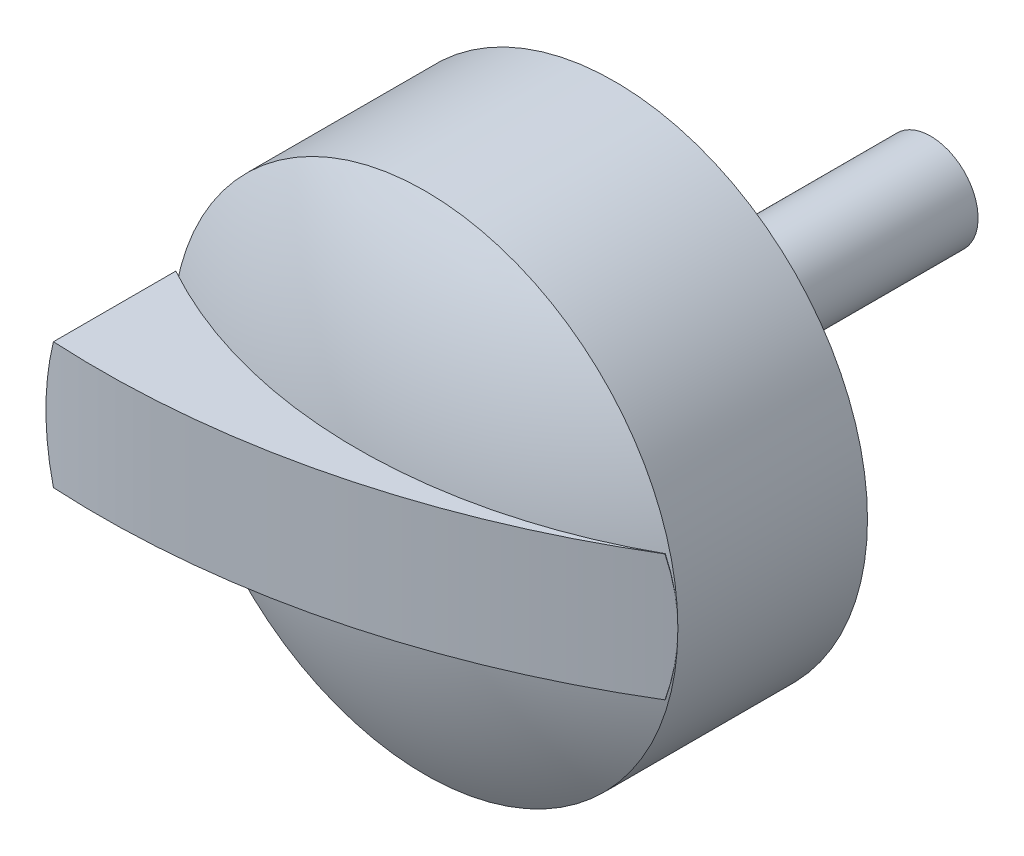
ISO-10303-21;
HEADER;
FILE_DESCRIPTION(('STEP AP214'),'2;1');
FILE_NAME('part.step','',(''),(''),'','','');
FILE_SCHEMA(('AUTOMOTIVE_DESIGN { 1 0 10303 214 1 1 1 1 }'));
ENDSEC;
DATA;
#1=APPLICATION_CONTEXT('core data for automotive mechanical design processes');
#2=APPLICATION_PROTOCOL_DEFINITION('international standard','automotive_design',2000,#1);
#3=PRODUCT_CONTEXT('',#1,'mechanical');
#4=PRODUCT('Part','Part','',(#3));
#5=PRODUCT_RELATED_PRODUCT_CATEGORY('part','',(#4));
#6=PRODUCT_DEFINITION_FORMATION('','',#4);
#7=PRODUCT_DEFINITION_CONTEXT('part definition',#1,'design');
#8=PRODUCT_DEFINITION('design','',#6,#7);
#9=PRODUCT_DEFINITION_SHAPE('','',#8);
#10=(LENGTH_UNIT() NAMED_UNIT(*) SI_UNIT(.MILLI.,.METRE.));
#11=(NAMED_UNIT(*) PLANE_ANGLE_UNIT() SI_UNIT($,.RADIAN.));
#12=(NAMED_UNIT(*) SI_UNIT($,.STERADIAN.) SOLID_ANGLE_UNIT());
#13=UNCERTAINTY_MEASURE_WITH_UNIT(LENGTH_MEASURE(1.E-05),#10,'distance_accuracy_value','');
#14=(GEOMETRIC_REPRESENTATION_CONTEXT(3) GLOBAL_UNCERTAINTY_ASSIGNED_CONTEXT((#13)) GLOBAL_UNIT_ASSIGNED_CONTEXT((#10,
#11,#12)) REPRESENTATION_CONTEXT('',''));
#15=CARTESIAN_POINT('',(0.,0.,0.));
#16=DIRECTION('',(0.,0.,1.));
#17=DIRECTION('',(1.,0.,0.));
#18=AXIS2_PLACEMENT_3D('',#15,#16,#17);
#19=CARTESIAN_POINT('',(0.,-2.,-7.8564064605511));
#20=DIRECTION('',(0.,1.,0.));
#21=DIRECTION('',(0.,0.,1.));
#22=AXIS2_PLACEMENT_3D('',#19,#20,#21);
#23=CYLINDRICAL_SURFACE('',#22,16.0000000000001);
#24=CARTESIAN_POINT('',(7.74596669241484,-2.,6.14359353944898));
#25=CARTESIAN_POINT('',(7.79576878568961,-1.80723335632212,6.11601122336093));
#26=CARTESIAN_POINT('',(7.83845275957321,-1.61207546205608,6.09207370153921));
#27=CARTESIAN_POINT('',(7.90921985467055,-1.21826146996199,6.05208391250416));
#28=CARTESIAN_POINT('',(7.93729738609222,-1.0196040629166,6.03603466421214));
#29=CARTESIAN_POINT('',(7.97795478606474,-0.625014635879123,6.01272209125138));
#30=CARTESIAN_POINT('',(7.99089022957565,-0.42913153883307,6.00525725997612));
#31=CARTESIAN_POINT('',(8.00232100847783,-0.0369095327974962,5.99866112683555));
#32=CARTESIAN_POINT('',(8.00082187339527,0.159429172845951,5.99952663382587));
#33=CARTESIAN_POINT('',(7.97982143754379,0.631381929789678,6.01164126361911));
#34=CARTESIAN_POINT('',(7.95321978946131,0.906632782986515,6.02698571878776));
#35=CARTESIAN_POINT('',(7.89200474609,1.31755744897251,6.06181080763411));
#36=CARTESIAN_POINT('',(7.86774300045165,1.45538772123495,6.07555866000076));
#37=CARTESIAN_POINT('',(7.81213288819257,1.72918322572561,6.1068160347439));
#38=CARTESIAN_POINT('',(7.78078441472819,1.8651484298022,6.12432561383419));
#39=CARTESIAN_POINT('',(7.74596669241484,2.,6.14359353944898));
#40=B_SPLINE_CURVE_WITH_KNOTS('',3,(#24,#25,#26,#27,#28,#29,#30,#31,#32,#33,#34,#35,#36,#37,#38,
#39),.UNSPECIFIED.,.F.,.F.,(4,2,2,2,2,2,2,4),(0.,0.602865336631131,1.20596121656099,
1.79459116140513,2.38299562580781,3.21164500910816,3.63331273593139,4.05498682048761),.UNSPECIFIED.);
#41=CARTESIAN_POINT('',(7.74596669241484,-2.,6.14359353944898));
#42=VERTEX_POINT('',#41);
#43=CARTESIAN_POINT('',(8.00000000000001,0.,6.));
#44=VERTEX_POINT('',#43);
#45=EDGE_CURVE('E142',#42,#44,#40,.T.);
#46=ORIENTED_EDGE('',*,*,#45,.F.);
#47=CARTESIAN_POINT('',(0.,-2.,-7.8564064605511));
#48=DIRECTION('',(0.,-1.,0.));
#49=DIRECTION('',(0.,0.,1.));
#50=AXIS2_PLACEMENT_3D('',#47,#48,#49);
#51=CIRCLE('',#50,16.0000000000001);
#52=CARTESIAN_POINT('',(-7.74596669241484,-2.,6.14359353944898));
#53=VERTEX_POINT('',#52);
#54=EDGE_CURVE('E117',#42,#53,#51,.T.);
#55=ORIENTED_EDGE('',*,*,#54,.T.);
#56=CARTESIAN_POINT('',(-7.74596669241484,2.,6.14359353944898));
#57=CARTESIAN_POINT('',(-7.79576878568961,1.80723335632212,6.11601122336093));
#58=CARTESIAN_POINT('',(-7.83845275957321,1.61207546205608,6.09207370153921));
#59=CARTESIAN_POINT('',(-7.90921985467055,1.21826146996199,6.05208391250416));
#60=CARTESIAN_POINT('',(-7.93729738609222,1.0196040629166,6.03603466421214));
#61=CARTESIAN_POINT('',(-7.97795478606474,0.625014635879123,6.01272209125138));
#62=CARTESIAN_POINT('',(-7.99089022957565,0.42913153883307,6.00525725997612));
#63=CARTESIAN_POINT('',(-8.00232100847783,0.0369095327974962,5.99866112683555));
#64=CARTESIAN_POINT('',(-8.00082187339527,-0.159429172845951,5.99952663382587));
#65=CARTESIAN_POINT('',(-7.97982143754379,-0.631381929789678,6.01164126361911));
#66=CARTESIAN_POINT('',(-7.95321978946131,-0.906632782986515,6.02698571878776));
#67=CARTESIAN_POINT('',(-7.89200474609,-1.31755744897251,6.06181080763411));
#68=CARTESIAN_POINT('',(-7.86774300045165,-1.45538772123495,6.07555866000076));
#69=CARTESIAN_POINT('',(-7.81213288819257,-1.72918322572561,6.1068160347439));
#70=CARTESIAN_POINT('',(-7.78078441472819,-1.8651484298022,6.12432561383419));
#71=CARTESIAN_POINT('',(-7.74596669241484,-2.,6.14359353944898));
#72=B_SPLINE_CURVE_WITH_KNOTS('',3,(#56,#57,#58,#59,#60,#61,#62,#63,#64,#65,#66,#67,#68,#69,#70,
#71),.UNSPECIFIED.,.F.,.F.,(4,2,2,2,2,2,2,4),(0.,0.602865336631131,1.20596121656099,
1.79459116140513,2.38299562580781,3.21164500910816,3.63331273593139,4.05498682048761),.UNSPECIFIED.);
#73=CARTESIAN_POINT('',(-7.74596669241484,2.,6.14359353944898));
#74=VERTEX_POINT('',#73);
#75=EDGE_CURVE('E104',#74,#53,#72,.T.);
#76=ORIENTED_EDGE('',*,*,#75,.F.);
#77=CARTESIAN_POINT('',(0.,2.,-7.8564064605511));
#78=DIRECTION('',(0.,-1.,0.));
#79=DIRECTION('',(0.,0.,1.));
#80=AXIS2_PLACEMENT_3D('',#77,#78,#79);
#81=CIRCLE('',#80,16.0000000000001);
#82=CARTESIAN_POINT('',(7.74596669241484,2.,6.14359353944898));
#83=VERTEX_POINT('',#82);
#84=EDGE_CURVE('E115',#83,#74,#81,.T.);
#85=ORIENTED_EDGE('',*,*,#84,.F.);
#86=EDGE_CURVE('E83',#44,#83,#40,.T.);
#87=ORIENTED_EDGE('',*,*,#86,.F.);
#88=EDGE_LOOP('',(#46,#55,#76,#85,#87));
#89=FACE_BOUND('',#88,.T.);
#90=ADVANCED_FACE('F61',(#89),#23,.F.);
#91=CARTESIAN_POINT('',(-6.23557158095201,-2.,-16.9422863238081));
#92=DIRECTION('',(0.,1.,0.));
#93=DIRECTION('',(0.,0.,1.));
#94=AXIS2_PLACEMENT_3D('',#91,#92,#93);
#95=CYLINDRICAL_SURFACE('',#94,27.);
#96=CARTESIAN_POINT('',(-7.74596669241484,-2.,10.0154343997114));
#97=CARTESIAN_POINT('',(-7.80271458237756,-1.7803181829167,10.0122340134564));
#98=CARTESIAN_POINT('',(-7.85006946093809,-1.55820558532786,10.0094210622351));
#99=CARTESIAN_POINT('',(-7.92576850211965,-1.11067742002907,10.0047909950926));
#100=CARTESIAN_POINT('',(-7.95410633457501,-0.885260777996712,10.0029742108002));
#101=CARTESIAN_POINT('',(-7.99111899857435,-0.437543151719545,10.0005850110123));
#102=CARTESIAN_POINT('',(-8.00019108510677,-0.215275063967891,9.99998746548465));
#103=CARTESIAN_POINT('',(-7.99980290286736,0.229145742237448,10.0000129285272));
#104=CARTESIAN_POINT('',(-7.99035096523731,0.451298467628083,10.0006353884025));
#105=CARTESIAN_POINT('',(-7.95287736313974,0.895353644935162,10.0030525170232));
#106=CARTESIAN_POINT('',(-7.92474581653544,1.1172467857351,10.004854121139));
#107=CARTESIAN_POINT('',(-7.84963261754137,1.56025072122013,10.0094473473001));
#108=CARTESIAN_POINT('',(-7.80245269307478,1.78132780183842,10.0122493456727));
#109=CARTESIAN_POINT('',(-7.74596669241484,2.,10.0154343997114));
#110=B_SPLINE_CURVE_WITH_KNOTS('',3,(#96,#97,#98,#99,#100,#101,#102,#103,#104,#105,#106,#107,
#108,#109),.UNSPECIFIED.,.F.,.F.,(4,2,2,2,2,2,4),(0.,0.680541398201196,1.36130921462671,
2.02789773688981,2.69418653113472,3.36442988456879,4.04183737584786),.UNSPECIFIED.);
#111=CARTESIAN_POINT('',(-7.74596669241484,-2.,10.0154343997114));
#112=VERTEX_POINT('',#111);
#113=CARTESIAN_POINT('',(-7.74596669241484,2.,10.0154343997114));
#114=VERTEX_POINT('',#113);
#115=EDGE_CURVE('E76',#112,#114,#110,.T.);
#116=ORIENTED_EDGE('',*,*,#115,.F.);
#117=CARTESIAN_POINT('',(-6.23557158095201,-2.,-16.9422863238081));
#118=DIRECTION('',(0.,1.,0.));
#119=DIRECTION('',(0.,0.,1.));
#120=AXIS2_PLACEMENT_3D('',#117,#118,#119);
#121=CIRCLE('',#120,27.);
#122=CARTESIAN_POINT('',(7.74596669241484,-2.,6.15569167233647));
#123=VERTEX_POINT('',#122);
#124=EDGE_CURVE('E110',#112,#123,#121,.T.);
#125=ORIENTED_EDGE('',*,*,#124,.T.);
#126=CARTESIAN_POINT('',(7.74596669241484,2.,6.15569167233647));
#127=CARTESIAN_POINT('',(7.79467250258487,1.81148274450204,6.12619328135844));
#128=CARTESIAN_POINT('',(7.83659379981564,1.62057130110441,6.10062232097364));
#129=CARTESIAN_POINT('',(7.90648127159817,1.23522757411276,6.05780547253232));
#130=CARTESIAN_POINT('',(7.93444265341626,1.04079410504151,6.0405624436967));
#131=CARTESIAN_POINT('',(7.97548207475387,0.654587101364144,6.01520652645346));
#132=CARTESIAN_POINT('',(7.98890744957409,0.462864841700527,6.00688062025187));
#133=CARTESIAN_POINT('',(8.00191871780278,0.0788716875453252,5.998810426956));
#134=CARTESIAN_POINT('',(8.00150942691493,-0.113398992744315,5.99906315372867));
#135=CARTESIAN_POINT('',(7.98329826514392,-0.589712924637729,6.01036117291011));
#136=CARTESIAN_POINT('',(7.95722212789143,-0.873397683775602,6.02654116033272));
#137=CARTESIAN_POINT('',(7.89551259212757,-1.29685153747375,6.06451689945988));
#138=CARTESIAN_POINT('',(7.87083993954408,-1.43896236605376,6.0796658333405));
#139=CARTESIAN_POINT('',(7.81398813798907,-1.72112753426659,6.11440389895734));
#140=CARTESIAN_POINT('',(7.78180894646594,-1.86118186223713,6.13399305586342));
#141=CARTESIAN_POINT('',(7.74596669241484,-2.,6.15569167233647));
#142=B_SPLINE_CURVE_WITH_KNOTS('',3,(#126,#127,#128,#129,#130,#131,#132,#133,#134,#135,#136,
#137,#138,#139,#140,#141),.UNSPECIFIED.,.F.,.F.,(4,2,2,2,2,2,2,4),(0.,0.590657314904661,
1.18151727572631,1.75792402338932,2.33413013190702,3.18759745368256,3.6224573950833,
4.05731980159376),.UNSPECIFIED.);
#143=EDGE_CURVE('E122',#44,#123,#142,.T.);
#144=ORIENTED_EDGE('',*,*,#143,.F.);
#145=CARTESIAN_POINT('',(7.74596669241484,2.,6.15569167233647));
#146=VERTEX_POINT('',#145);
#147=EDGE_CURVE('E127',#146,#44,#142,.T.);
#148=ORIENTED_EDGE('',*,*,#147,.F.);
#149=CARTESIAN_POINT('',(-6.23557158095201,2.,-16.9422863238081));
#150=DIRECTION('',(0.,1.,0.));
#151=DIRECTION('',(0.,0.,1.));
#152=AXIS2_PLACEMENT_3D('',#149,#150,#151);
#153=CIRCLE('',#152,27.);
#154=EDGE_CURVE('E121',#114,#146,#153,.T.);
#155=ORIENTED_EDGE('',*,*,#154,.F.);
#156=EDGE_LOOP('',(#116,#125,#144,#148,#155));
#157=FACE_BOUND('',#156,.T.);
#158=ADVANCED_FACE('F136',(#157),#95,.T.);
#159=CARTESIAN_POINT('',(0.,-2.,-7.8564064605511));
#160=DIRECTION('',(0.,1.,0.));
#161=DIRECTION('',(0.,0.,1.));
#162=AXIS2_PLACEMENT_3D('',#159,#160,#161);
#163=PLANE('',#162);
#164=ORIENTED_EDGE('',*,*,#54,.F.);
#165=DIRECTION('',(0.,0.,-1.));
#166=VECTOR('',#165,1.);
#167=CARTESIAN_POINT('',(7.74596669241484,-2.,12.));
#168=LINE('',#167,#166);
#169=EDGE_CURVE('E125',#42,#123,#168,.F.);
#170=ORIENTED_EDGE('',*,*,#169,.T.);
#171=ORIENTED_EDGE('',*,*,#124,.F.);
#172=DIRECTION('',(0.,0.,-1.));
#173=VECTOR('',#172,1.);
#174=CARTESIAN_POINT('',(-7.74596669241484,-2.,12.));
#175=LINE('',#174,#173);
#176=EDGE_CURVE('E118',#112,#53,#175,.T.);
#177=ORIENTED_EDGE('',*,*,#176,.T.);
#178=EDGE_LOOP('',(#164,#170,#171,#177));
#179=FACE_BOUND('',#178,.T.);
#180=ADVANCED_FACE('F140',(#179),#163,.F.);
#181=CARTESIAN_POINT('',(0.,2.,-7.8564064605511));
#182=DIRECTION('',(0.,1.,0.));
#183=DIRECTION('',(0.,0.,1.));
#184=AXIS2_PLACEMENT_3D('',#181,#182,#183);
#185=PLANE('',#184);
#186=DIRECTION('',(0.,0.,-1.));
#187=VECTOR('',#186,1.);
#188=CARTESIAN_POINT('',(7.74596669241484,2.,12.));
#189=LINE('',#188,#187);
#190=EDGE_CURVE('E13',#83,#146,#189,.F.);
#191=ORIENTED_EDGE('',*,*,#190,.F.);
#192=ORIENTED_EDGE('',*,*,#84,.T.);
#193=DIRECTION('',(0.,0.,-1.));
#194=VECTOR('',#193,1.);
#195=CARTESIAN_POINT('',(-7.74596669241484,2.,12.));
#196=LINE('',#195,#194);
#197=EDGE_CURVE('E69',#114,#74,#196,.T.);
#198=ORIENTED_EDGE('',*,*,#197,.F.);
#199=ORIENTED_EDGE('',*,*,#154,.T.);
#200=EDGE_LOOP('',(#191,#192,#198,#199));
#201=FACE_BOUND('',#200,.T.);
#202=ADVANCED_FACE('F120',(#201),#185,.T.);
#203=CARTESIAN_POINT('',(0.,0.,12.));
#204=DIRECTION('',(0.,0.,-1.));
#205=DIRECTION('',(-1.,0.,0.));
#206=AXIS2_PLACEMENT_3D('',#203,#204,#205);
#207=CYLINDRICAL_SURFACE('',#206,8.00000000000001);
#208=ORIENTED_EDGE('',*,*,#75,.T.);
#209=ORIENTED_EDGE('',*,*,#176,.F.);
#210=ORIENTED_EDGE('',*,*,#115,.T.);
#211=ORIENTED_EDGE('',*,*,#197,.T.);
#212=EDGE_LOOP('',(#208,#209,#210,#211));
#213=FACE_BOUND('',#212,.T.);
#214=ADVANCED_FACE('F103',(#213),#207,.T.);
#215=ORIENTED_EDGE('',*,*,#86,.T.);
#216=ORIENTED_EDGE('',*,*,#190,.T.);
#217=ORIENTED_EDGE('',*,*,#147,.T.);
#218=EDGE_LOOP('',(#215,#216,#217));
#219=FACE_BOUND('',#218,.T.);
#220=ADVANCED_FACE('F157',(#219),#207,.T.);
#221=ORIENTED_EDGE('',*,*,#143,.T.);
#222=ORIENTED_EDGE('',*,*,#169,.F.);
#223=ORIENTED_EDGE('',*,*,#45,.T.);
#224=EDGE_LOOP('',(#221,#222,#223));
#225=FACE_BOUND('',#224,.T.);
#226=ADVANCED_FACE('F153',(#225),#207,.T.);
#227=CLOSED_SHELL('',(#90,#158,#180,#202,#214,#220,#226));
#228=MANIFOLD_SOLID_BREP('B2',#227);
#229=CARTESIAN_POINT('',(0.,0.,6.));
#230=DIRECTION('',(0.,0.,-1.));
#231=DIRECTION('',(-1.,0.,0.));
#232=AXIS2_PLACEMENT_3D('',#229,#230,#231);
#233=CYLINDRICAL_SURFACE('',#232,4.5);
#234=CARTESIAN_POINT('',(0.,0.,6.));
#235=DIRECTION('',(0.,0.,1.));
#236=DIRECTION('',(1.,0.,0.));
#237=AXIS2_PLACEMENT_3D('',#234,#235,#236);
#238=CIRCLE('',#237,4.5);
#239=CARTESIAN_POINT('',(4.5,0.,6.));
#240=VERTEX_POINT('',#239);
#241=EDGE_CURVE('E258',#240,#240,#238,.T.);
#242=ORIENTED_EDGE('',*,*,#241,.F.);
#243=EDGE_LOOP('',(#242));
#244=FACE_BOUND('',#243,.T.);
#245=CARTESIAN_POINT('',(0.,0.,0.));
#246=DIRECTION('',(0.,0.,1.));
#247=DIRECTION('',(1.,0.,0.));
#248=AXIS2_PLACEMENT_3D('',#245,#246,#247);
#249=CIRCLE('',#248,4.5);
#250=CARTESIAN_POINT('',(4.5,0.,0.));
#251=VERTEX_POINT('',#250);
#252=EDGE_CURVE('E266',#251,#251,#249,.T.);
#253=ORIENTED_EDGE('',*,*,#252,.T.);
#254=EDGE_LOOP('',(#253));
#255=FACE_BOUND('',#254,.T.);
#256=ADVANCED_FACE('F245',(#244,#255),#233,.T.);
#257=CARTESIAN_POINT('',(0.,0.,0.));
#258=DIRECTION('',(0.,0.,1.));
#259=DIRECTION('',(1.,0.,0.));
#260=AXIS2_PLACEMENT_3D('',#257,#258,#259);
#261=PLANE('',#260);
#262=CARTESIAN_POINT('',(0.,0.,0.));
#263=DIRECTION('',(0.,0.,-1.));
#264=DIRECTION('',(-1.,0.,0.));
#265=AXIS2_PLACEMENT_3D('',#262,#263,#264);
#266=CIRCLE('',#265,1.5);
#267=CARTESIAN_POINT('',(-1.5,0.,0.));
#268=VERTEX_POINT('',#267);
#269=EDGE_CURVE('E60',#268,#268,#266,.T.);
#270=ORIENTED_EDGE('',*,*,#269,.F.);
#271=EDGE_LOOP('',(#270));
#272=FACE_BOUND('',#271,.T.);
#273=ORIENTED_EDGE('',*,*,#252,.F.);
#274=EDGE_LOOP('',(#273));
#275=FACE_BOUND('',#274,.T.);
#276=ADVANCED_FACE('F282',(#272,#275),#261,.F.);
#277=CARTESIAN_POINT('',(0.,0.,6.));
#278=DIRECTION('',(0.,0.,-1.));
#279=DIRECTION('',(-1.,0.,0.));
#280=AXIS2_PLACEMENT_3D('',#277,#278,#279);
#281=PLANE('',#280);
#282=CARTESIAN_POINT('',(0.,0.,6.));
#283=DIRECTION('',(0.,0.,-1.));
#284=DIRECTION('',(-1.,0.,0.));
#285=AXIS2_PLACEMENT_3D('',#282,#283,#284);
#286=CIRCLE('',#285,7.50000000000001);
#287=CARTESIAN_POINT('',(-7.50000000000001,0.,6.));
#288=VERTEX_POINT('',#287);
#289=EDGE_CURVE('E248',#288,#288,#286,.F.);
#290=ORIENTED_EDGE('',*,*,#289,.F.);
#291=EDGE_LOOP('',(#290));
#292=FACE_BOUND('',#291,.T.);
#293=ORIENTED_EDGE('',*,*,#241,.T.);
#294=EDGE_LOOP('',(#293));
#295=FACE_BOUND('',#294,.T.);
#296=ADVANCED_FACE('F284',(#292,#295),#281,.T.);
#297=CARTESIAN_POINT('',(0.,0.,6.));
#298=DIRECTION('',(0.,0.,-1.));
#299=DIRECTION('',(-1.,0.,0.));
#300=AXIS2_PLACEMENT_3D('',#297,#298,#299);
#301=CYLINDRICAL_SURFACE('',#300,7.50000000000001);
#302=ORIENTED_EDGE('',*,*,#289,.T.);
#303=EDGE_LOOP('',(#302));
#304=FACE_BOUND('',#303,.T.);
#305=CARTESIAN_POINT('',(0.,0.,0.));
#306=DIRECTION('',(0.,0.,1.));
#307=DIRECTION('',(1.,0.,0.));
#308=AXIS2_PLACEMENT_3D('',#305,#306,#307);
#309=CIRCLE('',#308,7.50000000000001);
#310=CARTESIAN_POINT('',(7.50000000000001,0.,0.));
#311=VERTEX_POINT('',#310);
#312=EDGE_CURVE('E268',#311,#311,#309,.T.);
#313=ORIENTED_EDGE('',*,*,#312,.F.);
#314=EDGE_LOOP('',(#313));
#315=FACE_BOUND('',#314,.T.);
#316=ADVANCED_FACE('F290',(#304,#315),#301,.F.);
#317=CARTESIAN_POINT('',(0.,0.,6.));
#318=DIRECTION('',(0.,0.,-1.));
#319=DIRECTION('',(-1.,0.,0.));
#320=AXIS2_PLACEMENT_3D('',#317,#318,#319);
#321=CYLINDRICAL_SURFACE('',#320,8.00000000000001);
#322=CARTESIAN_POINT('',(0.,0.,6.));
#323=DIRECTION('',(0.,0.,1.));
#324=DIRECTION('',(1.,0.,0.));
#325=AXIS2_PLACEMENT_3D('',#322,#323,#324);
#326=CIRCLE('',#325,8.00000000000001);
#327=CARTESIAN_POINT('',(8.00000000000001,0.,6.));
#328=VERTEX_POINT('',#327);
#329=EDGE_CURVE('E262',#328,#328,#326,.T.);
#330=ORIENTED_EDGE('',*,*,#329,.F.);
#331=EDGE_LOOP('',(#330));
#332=FACE_BOUND('',#331,.T.);
#333=CARTESIAN_POINT('',(0.,0.,0.));
#334=DIRECTION('',(0.,0.,1.));
#335=DIRECTION('',(1.,0.,0.));
#336=AXIS2_PLACEMENT_3D('',#333,#334,#335);
#337=CIRCLE('',#336,8.00000000000001);
#338=CARTESIAN_POINT('',(8.00000000000001,0.,0.));
#339=VERTEX_POINT('',#338);
#340=EDGE_CURVE('E267',#339,#339,#337,.T.);
#341=ORIENTED_EDGE('',*,*,#340,.T.);
#342=EDGE_LOOP('',(#341));
#343=FACE_BOUND('',#342,.T.);
#344=ADVANCED_FACE('F303',(#332,#343),#321,.T.);
#345=CARTESIAN_POINT('',(0.,0.,0.));
#346=DIRECTION('',(0.,0.,1.));
#347=DIRECTION('',(1.,0.,0.));
#348=AXIS2_PLACEMENT_3D('',#345,#346,#347);
#349=PLANE('',#348);
#350=ORIENTED_EDGE('',*,*,#312,.T.);
#351=EDGE_LOOP('',(#350));
#352=FACE_BOUND('',#351,.T.);
#353=ORIENTED_EDGE('',*,*,#340,.F.);
#354=EDGE_LOOP('',(#353));
#355=FACE_BOUND('',#354,.T.);
#356=ADVANCED_FACE('F298',(#352,#355),#349,.F.);
#357=CARTESIAN_POINT('',(0.,0.,-7.85640646055101));
#358=DIRECTION('',(0.,0.,1.));
#359=DIRECTION('',(0.,1.,0.));
#360=AXIS2_PLACEMENT_3D('',#357,#358,#359);
#361=SPHERICAL_SURFACE('',#360,16.);
#362=ORIENTED_EDGE('',*,*,#329,.T.);
#363=EDGE_LOOP('',(#362));
#364=FACE_BOUND('',#363,.T.);
#365=ADVANCED_FACE('F295',(#364),#361,.T.);
#366=CARTESIAN_POINT('',(0.,0.,-10.));
#367=DIRECTION('',(0.,0.,1.));
#368=DIRECTION('',(1.,0.,0.));
#369=AXIS2_PLACEMENT_3D('',#366,#367,#368);
#370=CYLINDRICAL_SURFACE('',#369,1.5);
#371=CARTESIAN_POINT('',(0.,0.,-10.));
#372=DIRECTION('',(0.,0.,-1.));
#373=DIRECTION('',(-1.,0.,0.));
#374=AXIS2_PLACEMENT_3D('',#371,#372,#373);
#375=CIRCLE('',#374,1.5);
#376=CARTESIAN_POINT('',(-1.5,0.,-10.));
#377=VERTEX_POINT('',#376);
#378=EDGE_CURVE('E261',#377,#377,#375,.T.);
#379=ORIENTED_EDGE('',*,*,#378,.F.);
#380=EDGE_LOOP('',(#379));
#381=FACE_BOUND('',#380,.T.);
#382=ORIENTED_EDGE('',*,*,#269,.T.);
#383=EDGE_LOOP('',(#382));
#384=FACE_BOUND('',#383,.T.);
#385=ADVANCED_FACE('F297',(#381,#384),#370,.T.);
#386=CARTESIAN_POINT('',(0.,0.,-10.));
#387=DIRECTION('',(0.,0.,-1.));
#388=DIRECTION('',(-1.,0.,0.));
#389=AXIS2_PLACEMENT_3D('',#386,#387,#388);
#390=PLANE('',#389);
#391=ORIENTED_EDGE('',*,*,#378,.T.);
#392=EDGE_LOOP('',(#391));
#393=FACE_BOUND('',#392,.T.);
#394=ADVANCED_FACE('F313',(#393),#390,.T.);
#395=CLOSED_SHELL('',(#256,#276,#296,#316,#344,#356,#365,#385,#394));
#396=MANIFOLD_SOLID_BREP('B7',#395);
#397=ADVANCED_BREP_SHAPE_REPRESENTATION('',(#18,#228,#396),#14);
#398=SHAPE_DEFINITION_REPRESENTATION(#9,#397);
ENDSEC;
END-ISO-10303-21;
